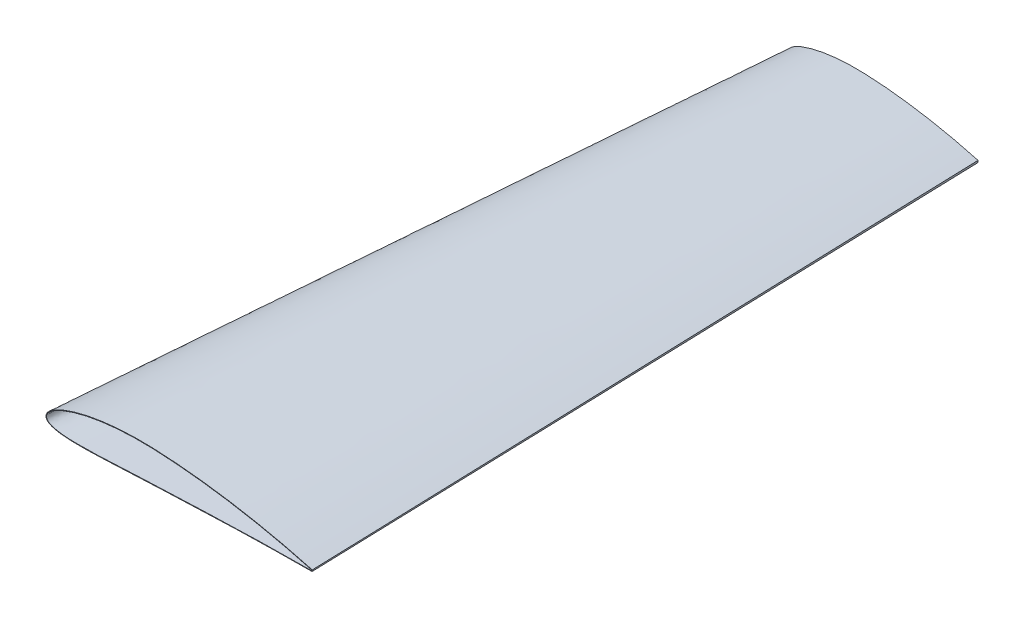
ISO-10303-21;
HEADER;
FILE_DESCRIPTION(('STEP AP214'),'2;1');
FILE_NAME('part.step','',(''),(''),'','','');
FILE_SCHEMA(('AUTOMOTIVE_DESIGN { 1 0 10303 214 1 1 1 1 }'));
ENDSEC;
DATA;
#1=APPLICATION_CONTEXT('core data for automotive mechanical design processes');
#2=APPLICATION_PROTOCOL_DEFINITION('international standard','automotive_design',2000,#1);
#3=PRODUCT_CONTEXT('',#1,'mechanical');
#4=PRODUCT('Part','Part','',(#3));
#5=PRODUCT_RELATED_PRODUCT_CATEGORY('part','',(#4));
#6=PRODUCT_DEFINITION_FORMATION('','',#4);
#7=PRODUCT_DEFINITION_CONTEXT('part definition',#1,'design');
#8=PRODUCT_DEFINITION('design','',#6,#7);
#9=PRODUCT_DEFINITION_SHAPE('','',#8);
#10=(LENGTH_UNIT() NAMED_UNIT(*) SI_UNIT(.MILLI.,.METRE.));
#11=(NAMED_UNIT(*) PLANE_ANGLE_UNIT() SI_UNIT($,.RADIAN.));
#12=(NAMED_UNIT(*) SI_UNIT($,.STERADIAN.) SOLID_ANGLE_UNIT());
#13=UNCERTAINTY_MEASURE_WITH_UNIT(LENGTH_MEASURE(1.E-05),#10,'distance_accuracy_value','');
#14=(GEOMETRIC_REPRESENTATION_CONTEXT(3) GLOBAL_UNCERTAINTY_ASSIGNED_CONTEXT((#13)) GLOBAL_UNIT_ASSIGNED_CONTEXT((#10,
#11,#12)) REPRESENTATION_CONTEXT('',''));
#15=CARTESIAN_POINT('',(0.,0.,0.));
#16=DIRECTION('',(0.,0.,1.));
#17=DIRECTION('',(1.,0.,0.));
#18=AXIS2_PLACEMENT_3D('',#15,#16,#17);
#19=CARTESIAN_POINT('',(515.542466757651,1.37291715323749,0.));
#20=CARTESIAN_POINT('',(473.761354348708,1.91504334392476,-1333.5));
#21=CARTESIAN_POINT('',(504.948186056162,4.31562778068404,0.));
#22=CARTESIAN_POINT('',(466.241241660713,4.00387151815679,-1333.5));
#23=CARTESIAN_POINT('',(483.688630885925,9.95175823918553,0.));
#24=CARTESIAN_POINT('',(451.160493971408,8.03690502890336,-1333.5));
#25=CARTESIAN_POINT('',(440.91840439398,20.2408017386491,0.));
#26=CARTESIAN_POINT('',(420.805599887962,15.3578375738474,-1333.5));
#27=CARTESIAN_POINT('',(397.820792051191,29.0759377638442,0.));
#28=CARTESIAN_POINT('',(390.221957363054,21.65962794748,-1333.5));
#29=CARTESIAN_POINT('',(354.460600672312,36.4782376927597,0.));
#30=CARTESIAN_POINT('',(359.448862171338,26.9396472162238,-1333.5));
#31=CARTESIAN_POINT('',(321.821436127745,41.287280697128,0.));
#32=CARTESIAN_POINT('',(336.282822397605,30.3682918829064,-1333.5));
#33=CARTESIAN_POINT('',(289.075414397088,45.3159399144746,0.));
#34=CARTESIAN_POINT('',(313.039072197383,33.2450825322831,-1333.5));
#35=CARTESIAN_POINT('',(256.234249309476,48.5142512287238,0.));
#36=CARTESIAN_POINT('',(289.723976775768,35.5318134186845,-1333.5));
#37=CARTESIAN_POINT('',(223.317458576892,50.787173233681,0.));
#38=CARTESIAN_POINT('',(266.354818287414,37.1599691175304,-1333.5));
#39=CARTESIAN_POINT('',(190.328241158101,52.0921492363557,0.));
#40=CARTESIAN_POINT('',(242.91690860674,38.106258583374,-1333.5));
#41=CARTESIAN_POINT('',(162.799790856734,51.7149612737425,0.));
#42=CARTESIAN_POINT('',(223.339605024856,37.8569374336063,-1333.5));
#43=CARTESIAN_POINT('',(140.815010685056,50.4814113602434,0.));
#44=CARTESIAN_POINT('',(207.702823599273,36.9927518576321,-1333.5));
#45=CARTESIAN_POINT('',(124.359909385153,49.0521108646724,0.));
#46=CARTESIAN_POINT('',(195.99602938729,35.9854835703815,-1333.5));
#47=CARTESIAN_POINT('',(107.957329171461,47.0863508807158,0.));
#48=CARTESIAN_POINT('',(184.323035776176,34.59573007404,-1333.5));
#49=CARTESIAN_POINT('',(91.631280061329,44.5372092186544,0.));
#50=CARTESIAN_POINT('',(172.700036204777,32.7897404844962,-1333.5));
#51=CARTESIAN_POINT('',(75.4136360051635,41.3429509123251,0.));
#52=CARTESIAN_POINT('',(161.148094659947,30.5229468259909,-1333.5));
#53=CARTESIAN_POINT('',(62.025702194082,38.0735505204426,0.));
#54=CARTESIAN_POINT('',(151.604465980378,28.1992444571214,-1333.5));
#55=CARTESIAN_POINT('',(51.4266197848401,35.0260164169072,0.));
#56=CARTESIAN_POINT('',(144.041887446398,26.0301562795153,-1333.5));
#57=CARTESIAN_POINT('',(43.5465568697689,32.4984583099507,0.));
#58=CARTESIAN_POINT('',(138.41449545024,24.2291788913945,-1333.5));
#59=CARTESIAN_POINT('',(35.7541118725182,29.6956733272348,0.));
#60=CARTESIAN_POINT('',(132.843221370915,22.2293587302536,-1333.5));
#61=CARTESIAN_POINT('',(28.0755124200348,26.5705691180233,0.));
#62=CARTESIAN_POINT('',(127.343608813039,19.9952999808497,-1333.5));
#63=CARTESIAN_POINT('',(20.555874406315,23.0470024261619,0.));
#64=CARTESIAN_POINT('',(121.942599672116,17.4689180578259,-1333.5));
#65=CARTESIAN_POINT('',(14.4837569810482,19.6800078711009,0.));
#66=CARTESIAN_POINT('',(117.559968245804,15.04337614627,-1333.5));
#67=CARTESIAN_POINT('',(9.83082821996991,16.6046362541371,0.));
#68=CARTESIAN_POINT('',(114.174757892656,12.8096231690394,-1333.5));
#69=CARTESIAN_POINT('',(6.4884133940203,14.0525883692153,0.));
#70=CARTESIAN_POINT('',(111.721318113505,10.9395579815021,-1333.5));
#71=CARTESIAN_POINT('',(3.37411745860041,11.1653229429713,0.));
#72=CARTESIAN_POINT('',(109.404447868835,8.79585196070452,-1333.5));
#73=CARTESIAN_POINT('',(1.10893170730452,8.36681188823188,0.));
#74=CARTESIAN_POINT('',(107.664063642287,6.65710221065554,-1333.5));
#75=CARTESIAN_POINT('',(-0.301805281426847,5.74949525675526,0.));
#76=CARTESIAN_POINT('',(106.551977804266,4.5904851843582,-1333.5));
#77=CARTESIAN_POINT('',(-1.01759194588757,3.60243572224438,0.));
#78=CARTESIAN_POINT('',(105.953611387231,2.81739605685466,-1333.5));
#79=CARTESIAN_POINT('',(-1.2495522623254,1.27648595976914,0.));
#80=CARTESIAN_POINT('',(105.759156489465,0.850568134802958,-1333.5));
#81=CARTESIAN_POINT('',(-0.871053522600669,-1.0536259455248,0.));
#82=CARTESIAN_POINT('',(106.089924423004,-1.15154539440468,-1333.5));
#83=CARTESIAN_POINT('',(0.0925312647460494,-3.18620229908168,0.));
#84=CARTESIAN_POINT('',(106.914986624156,-2.95461732726503,-1333.5));
#85=CARTESIAN_POINT('',(1.96587574601528,-5.5997712947529,0.));
#86=CARTESIAN_POINT('',(108.477470245047,-4.94678785829278,-1333.5));
#87=CARTESIAN_POINT('',(4.91676019063022,-7.81472721090731,0.));
#88=CARTESIAN_POINT('',(110.800424548259,-6.66376143743772,-1333.5));
#89=CARTESIAN_POINT('',(8.76335605849131,-9.68666142986385,0.));
#90=CARTESIAN_POINT('',(113.698800911527,-8.06494132796826,-1333.5));
#91=CARTESIAN_POINT('',(12.7457170988457,-11.0838560935036,0.));
#92=CARTESIAN_POINT('',(116.635824452286,-9.08879735743914,-1333.5));
#93=CARTESIAN_POINT('',(16.7924123227071,-12.1621059985243,0.));
#94=CARTESIAN_POINT('',(119.584839473497,-9.87029719797451,-1333.5));
#95=CARTESIAN_POINT('',(22.2359674012003,-13.2958830810498,0.));
#96=CARTESIAN_POINT('',(123.524096136929,-10.6860636031594,-1333.5));
#97=CARTESIAN_POINT('',(29.0875943161226,-14.2923489224896,0.));
#98=CARTESIAN_POINT('',(128.447397124961,-11.3972340966206,-1333.5));
#99=CARTESIAN_POINT('',(37.3368750688352,-15.0677746567505,0.));
#100=CARTESIAN_POINT('',(134.349639581766,-11.947718634808,-1333.5));
#101=CARTESIAN_POINT('',(45.5951521604237,-15.5505139378374,0.));
#102=CARTESIAN_POINT('',(140.242283827755,-12.2886242625503,-1333.5));
#103=CARTESIAN_POINT('',(53.8553570900479,-15.8209667772946,0.));
#104=CARTESIAN_POINT('',(146.127060513623,-12.4782668123123,-1333.5));
#105=CARTESIAN_POINT('',(62.1137750735132,-15.9283521329175,0.));
#106=CARTESIAN_POINT('',(152.003712865923,-12.552064863902,-1333.5));
#107=CARTESIAN_POINT('',(73.1205588589155,-15.9055453611833,0.));
#108=CARTESIAN_POINT('',(159.829522788246,-12.5328344567209,-1333.5));
#109=CARTESIAN_POINT('',(86.8699195436529,-15.6312499740422,0.));
#110=CARTESIAN_POINT('',(169.596582504585,-12.3348738263077,-1333.5));
#111=CARTESIAN_POINT('',(103.354857804001,-15.0577240266216,0.));
#112=CARTESIAN_POINT('',(181.297956986089,-11.9250394308122,-1333.5));
#113=CARTESIAN_POINT('',(119.82883830323,-14.3351980837164,0.));
#114=CARTESIAN_POINT('',(192.985214326049,-11.4106375817264,-1333.5));
#115=CARTESIAN_POINT('',(136.295462455293,-13.5306329693252,0.));
#116=CARTESIAN_POINT('',(204.662814159789,-10.8390693642151,-1333.5));
#117=CARTESIAN_POINT('',(158.245357802019,-12.4217886668498,0.));
#118=CARTESIAN_POINT('',(220.224309063749,-10.0527014635403,-1333.5));
#119=CARTESIAN_POINT('',(185.677219006089,-11.0451104976105,0.));
#120=CARTESIAN_POINT('',(239.663674820272,-9.07928745888814,-1333.5));
#121=CARTESIAN_POINT('',(218.611438330042,-9.79297803817341,0.));
#122=CARTESIAN_POINT('',(263.00207611691,-8.19568423864289,-1333.5));
#123=CARTESIAN_POINT('',(251.555145610756,-8.43171617870903,0.));
#124=CARTESIAN_POINT('',(286.363804333461,-7.22745079121833,-1333.5));
#125=CARTESIAN_POINT('',(284.490185789946,-7.05887027421826,0.));
#126=CARTESIAN_POINT('',(309.70924451459,-6.25554907479826,-1333.5));
#127=CARTESIAN_POINT('',(328.406681851027,-5.3338827127236,0.));
#128=CARTESIAN_POINT('',(340.837133227643,-5.03573266395796,-1333.5));
#129=CARTESIAN_POINT('',(383.311814556076,-3.53289934021423,0.));
#130=CARTESIAN_POINT('',(379.748805846812,-3.76689211807182,-1333.5));
#131=CARTESIAN_POINT('',(449.217902368611,-2.16377935447564,0.));
#132=CARTESIAN_POINT('',(426.454575487254,-2.80665513508761,-1333.5));
#133=CARTESIAN_POINT('',(493.166185563474,-1.76961340399107,0.));
#134=CARTESIAN_POINT('',(457.604517174587,-2.5374479327564,-1333.5));
#135=CARTESIAN_POINT('',(515.140000287505,-1.63716151339865,0.));
#136=CARTESIAN_POINT('',(473.17857996649,-2.44353039794196,-1333.5));
#137=B_SPLINE_SURFACE_WITH_KNOTS('',3,1,((#19,#20),(#21,#22),(#23,#24),(#25,#26),(#27,#28),(#29,
#30),(#31,#32),(#33,#34),(#35,#36),(#37,#38),(#39,#40),(#41,#42),(#43,#44),(#45,#46),(#47,#48),
(#49,#50),(#51,#52),(#53,#54),(#55,#56),(#57,#58),(#59,#60),(#61,#62),(#63,#64),(#65,#66),(#67,
#68),(#69,#70),(#71,#72),(#73,#74),(#75,#76),(#77,#78),(#79,#80),(#81,#82),(#83,#84),(#85,#86),
(#87,#88),(#89,#90),(#91,#92),(#93,#94),(#95,#96),(#97,#98),(#99,#100),(#101,#102),(#103,#104),
(#105,#106),(#107,#108),(#109,#110),(#111,#112),(#113,#114),(#115,#116),(#117,#118),(#119,#120),
(#121,#122),(#123,#124),(#125,#126),(#127,#128),(#129,#130),(#131,#132),(#133,#134),(#135,
#136)),.UNSPECIFIED.,.F.,.F.,.F.,(4,1,1,1,1,1,1,1,1,1,1,1,1,1,1,1,1,1,1,1,1,1,1,1,1,1,1,1,1,1,1,
1,1,1,1,1,1,1,1,1,1,1,1,1,1,1,1,1,1,1,1,1,1,1,1,1,4),(2,2),(0.,0.03125,0.0625,0.125,0.15625,
0.1875,0.21875,0.25,0.28125,0.3125,0.34375,0.359375,0.375,0.390625,0.40625,0.421875,0.4375,
0.4453125,0.453125,0.4609375,0.46875,0.4765625,0.484375,0.48828125,0.4921875,0.49609375,0.5,
0.501953125,0.50390625,0.505859375,0.5078125,0.509765625,0.51171875,0.515625,0.51953125,
0.5234375,0.52734375,0.53125,0.5390625,0.546875,0.5546875,0.5625,0.5703125,0.578125,0.59375,
0.609375,0.625,0.640625,0.65625,0.6875,0.71875,0.75,0.78125,0.8125,0.875,0.9375,1.),(0.,1.),.UNSPECIFIED.);
#138=CARTESIAN_POINT('',(515.542466757651,1.37291715323749,0.));
#139=CARTESIAN_POINT('',(504.948186056162,4.31562778068404,0.));
#140=CARTESIAN_POINT('',(483.688630885925,9.95175823918553,0.));
#141=CARTESIAN_POINT('',(440.91840439398,20.2408017386491,0.));
#142=CARTESIAN_POINT('',(397.820792051191,29.0759377638442,0.));
#143=CARTESIAN_POINT('',(354.460600672312,36.4782376927597,0.));
#144=CARTESIAN_POINT('',(321.821436127745,41.287280697128,0.));
#145=CARTESIAN_POINT('',(289.075414397088,45.3159399144746,0.));
#146=CARTESIAN_POINT('',(256.234249309476,48.5142512287238,0.));
#147=CARTESIAN_POINT('',(223.317458576892,50.787173233681,0.));
#148=CARTESIAN_POINT('',(190.328241158101,52.0921492363557,0.));
#149=CARTESIAN_POINT('',(162.799790856734,51.7149612737425,0.));
#150=CARTESIAN_POINT('',(140.815010685056,50.4814113602434,0.));
#151=CARTESIAN_POINT('',(124.359909385153,49.0521108646724,0.));
#152=CARTESIAN_POINT('',(107.957329171461,47.0863508807158,0.));
#153=CARTESIAN_POINT('',(91.631280061329,44.5372092186544,0.));
#154=CARTESIAN_POINT('',(75.4136360051635,41.3429509123251,0.));
#155=CARTESIAN_POINT('',(62.025702194082,38.0735505204426,0.));
#156=CARTESIAN_POINT('',(51.4266197848401,35.0260164169072,0.));
#157=CARTESIAN_POINT('',(43.5465568697689,32.4984583099507,0.));
#158=CARTESIAN_POINT('',(35.7541118725182,29.6956733272348,0.));
#159=CARTESIAN_POINT('',(28.0755124200348,26.5705691180233,0.));
#160=CARTESIAN_POINT('',(20.555874406315,23.0470024261619,0.));
#161=CARTESIAN_POINT('',(14.4837569810482,19.6800078711009,0.));
#162=CARTESIAN_POINT('',(9.83082821996991,16.6046362541371,0.));
#163=CARTESIAN_POINT('',(6.4884133940203,14.0525883692153,0.));
#164=CARTESIAN_POINT('',(3.37411745860041,11.1653229429713,0.));
#165=CARTESIAN_POINT('',(1.10893170730452,8.36681188823188,0.));
#166=CARTESIAN_POINT('',(-0.301805281426847,5.74949525675526,0.));
#167=CARTESIAN_POINT('',(-1.01759194588757,3.60243572224438,0.));
#168=CARTESIAN_POINT('',(-1.2495522623254,1.27648595976914,0.));
#169=CARTESIAN_POINT('',(-0.871053522600669,-1.0536259455248,0.));
#170=CARTESIAN_POINT('',(0.0925312647460494,-3.18620229908168,0.));
#171=CARTESIAN_POINT('',(1.96587574601528,-5.5997712947529,0.));
#172=CARTESIAN_POINT('',(4.91676019063022,-7.81472721090731,0.));
#173=CARTESIAN_POINT('',(8.76335605849131,-9.68666142986385,0.));
#174=CARTESIAN_POINT('',(12.7457170988457,-11.0838560935036,0.));
#175=CARTESIAN_POINT('',(16.7924123227071,-12.1621059985243,0.));
#176=CARTESIAN_POINT('',(22.2359674012003,-13.2958830810498,0.));
#177=CARTESIAN_POINT('',(29.0875943161226,-14.2923489224896,0.));
#178=CARTESIAN_POINT('',(37.3368750688352,-15.0677746567505,0.));
#179=CARTESIAN_POINT('',(45.5951521604237,-15.5505139378374,0.));
#180=CARTESIAN_POINT('',(53.8553570900479,-15.8209667772946,0.));
#181=CARTESIAN_POINT('',(62.1137750735132,-15.9283521329175,0.));
#182=CARTESIAN_POINT('',(73.1205588589155,-15.9055453611833,0.));
#183=CARTESIAN_POINT('',(86.8699195436529,-15.6312499740422,0.));
#184=CARTESIAN_POINT('',(103.354857804001,-15.0577240266216,0.));
#185=CARTESIAN_POINT('',(119.82883830323,-14.3351980837164,0.));
#186=CARTESIAN_POINT('',(136.295462455293,-13.5306329693252,0.));
#187=CARTESIAN_POINT('',(158.245357802019,-12.4217886668498,0.));
#188=CARTESIAN_POINT('',(185.677219006089,-11.0451104976105,0.));
#189=CARTESIAN_POINT('',(218.611438330042,-9.79297803817341,0.));
#190=CARTESIAN_POINT('',(251.555145610756,-8.43171617870903,0.));
#191=CARTESIAN_POINT('',(284.490185789946,-7.05887027421826,0.));
#192=CARTESIAN_POINT('',(328.406681851027,-5.3338827127236,0.));
#193=CARTESIAN_POINT('',(383.311814556076,-3.53289934021423,0.));
#194=CARTESIAN_POINT('',(449.217902368611,-2.16377935447564,0.));
#195=CARTESIAN_POINT('',(493.166185563474,-1.76961340399107,0.));
#196=CARTESIAN_POINT('',(515.140000287505,-1.63716151339865,0.));
#197=B_SPLINE_CURVE_WITH_KNOTS('',3,(#138,#139,#140,#141,#142,#143,#144,#145,#146,#147,#148,
#149,#150,#151,#152,#153,#154,#155,#156,#157,#158,#159,#160,#161,#162,#163,#164,#165,#166,#167,
#168,#169,#170,#171,#172,#173,#174,#175,#176,#177,#178,#179,#180,#181,#182,#183,#184,#185,#186,
#187,#188,#189,#190,#191,#192,#193,#194,#195,#196),.UNSPECIFIED.,.F.,.F.,(4,1,1,1,1,1,1,1,1,1,1,
1,1,1,1,1,1,1,1,1,1,1,1,1,1,1,1,1,1,1,1,1,1,1,1,1,1,1,1,1,1,1,1,1,1,1,1,1,1,1,1,1,1,1,1,1,4),
(0.,0.03125,0.0625,0.125,0.15625,0.1875,0.21875,0.25,0.28125,0.3125,0.34375,0.359375,0.375,
0.390625,0.40625,0.421875,0.4375,0.4453125,0.453125,0.4609375,0.46875,0.4765625,0.484375,
0.48828125,0.4921875,0.49609375,0.5,0.501953125,0.50390625,0.505859375,0.5078125,0.509765625,
0.51171875,0.515625,0.51953125,0.5234375,0.52734375,0.53125,0.5390625,0.546875,0.5546875,0.5625,
0.5703125,0.578125,0.59375,0.609375,0.625,0.640625,0.65625,0.6875,0.71875,0.75,0.78125,0.8125,
0.875,0.9375,1.),.UNSPECIFIED.);
#198=CARTESIAN_POINT('',(515.542466757651,1.37291715323749,0.));
#199=VERTEX_POINT('',#198);
#200=CARTESIAN_POINT('',(515.140000287505,-1.63716151339865,0.));
#201=VERTEX_POINT('',#200);
#202=EDGE_CURVE('E11',#199,#201,#197,.T.);
#203=DIRECTION('',(-0.0313165474447222,0.000406344388476608,-0.999509434042711));
#204=VECTOR('',#203,1.);
#205=CARTESIAN_POINT('',(494.651910553179,1.64398024858112,-666.75));
#206=LINE('',#205,#204);
#207=CARTESIAN_POINT('',(473.761354348708,1.91504334392476,-1333.5));
#208=VERTEX_POINT('',#207);
#209=EDGE_CURVE('E115',#199,#208,#206,.T.);
#210=CARTESIAN_POINT('',(473.761354348708,1.91504334392476,-1333.5));
#211=CARTESIAN_POINT('',(466.241241660713,4.00387151815679,-1333.5));
#212=CARTESIAN_POINT('',(451.160493971408,8.03690502890336,-1333.5));
#213=CARTESIAN_POINT('',(420.805599887962,15.3578375738474,-1333.5));
#214=CARTESIAN_POINT('',(390.221957363054,21.65962794748,-1333.5));
#215=CARTESIAN_POINT('',(359.448862171338,26.9396472162238,-1333.5));
#216=CARTESIAN_POINT('',(336.282822397605,30.3682918829064,-1333.5));
#217=CARTESIAN_POINT('',(313.039072197383,33.2450825322831,-1333.5));
#218=CARTESIAN_POINT('',(289.723976775768,35.5318134186845,-1333.5));
#219=CARTESIAN_POINT('',(266.354818287414,37.1599691175304,-1333.5));
#220=CARTESIAN_POINT('',(242.91690860674,38.106258583374,-1333.5));
#221=CARTESIAN_POINT('',(223.339605024856,37.8569374336063,-1333.5));
#222=CARTESIAN_POINT('',(207.702823599273,36.9927518576321,-1333.5));
#223=CARTESIAN_POINT('',(195.99602938729,35.9854835703815,-1333.5));
#224=CARTESIAN_POINT('',(184.323035776176,34.59573007404,-1333.5));
#225=CARTESIAN_POINT('',(172.700036204777,32.7897404844962,-1333.5));
#226=CARTESIAN_POINT('',(161.148094659947,30.5229468259909,-1333.5));
#227=CARTESIAN_POINT('',(151.604465980378,28.1992444571214,-1333.5));
#228=CARTESIAN_POINT('',(144.041887446398,26.0301562795153,-1333.5));
#229=CARTESIAN_POINT('',(138.41449545024,24.2291788913945,-1333.5));
#230=CARTESIAN_POINT('',(132.843221370915,22.2293587302536,-1333.5));
#231=CARTESIAN_POINT('',(127.343608813039,19.9952999808497,-1333.5));
#232=CARTESIAN_POINT('',(121.942599672116,17.4689180578259,-1333.5));
#233=CARTESIAN_POINT('',(117.559968245804,15.04337614627,-1333.5));
#234=CARTESIAN_POINT('',(114.174757892656,12.8096231690394,-1333.5));
#235=CARTESIAN_POINT('',(111.721318113505,10.9395579815021,-1333.5));
#236=CARTESIAN_POINT('',(109.404447868835,8.79585196070452,-1333.5));
#237=CARTESIAN_POINT('',(107.664063642287,6.65710221065554,-1333.5));
#238=CARTESIAN_POINT('',(106.551977804266,4.5904851843582,-1333.5));
#239=CARTESIAN_POINT('',(105.953611387231,2.81739605685466,-1333.5));
#240=CARTESIAN_POINT('',(105.759156489465,0.850568134802958,-1333.5));
#241=CARTESIAN_POINT('',(106.089924423004,-1.15154539440468,-1333.5));
#242=CARTESIAN_POINT('',(106.914986624156,-2.95461732726503,-1333.5));
#243=CARTESIAN_POINT('',(108.477470245047,-4.94678785829278,-1333.5));
#244=CARTESIAN_POINT('',(110.800424548259,-6.66376143743772,-1333.5));
#245=CARTESIAN_POINT('',(113.698800911527,-8.06494132796826,-1333.5));
#246=CARTESIAN_POINT('',(116.635824452286,-9.08879735743914,-1333.5));
#247=CARTESIAN_POINT('',(119.584839473497,-9.87029719797451,-1333.5));
#248=CARTESIAN_POINT('',(123.524096136929,-10.6860636031594,-1333.5));
#249=CARTESIAN_POINT('',(128.447397124961,-11.3972340966206,-1333.5));
#250=CARTESIAN_POINT('',(134.349639581766,-11.947718634808,-1333.5));
#251=CARTESIAN_POINT('',(140.242283827755,-12.2886242625503,-1333.5));
#252=CARTESIAN_POINT('',(146.127060513623,-12.4782668123123,-1333.5));
#253=CARTESIAN_POINT('',(152.003712865923,-12.552064863902,-1333.5));
#254=CARTESIAN_POINT('',(159.829522788246,-12.5328344567209,-1333.5));
#255=CARTESIAN_POINT('',(169.596582504585,-12.3348738263077,-1333.5));
#256=CARTESIAN_POINT('',(181.297956986089,-11.9250394308122,-1333.5));
#257=CARTESIAN_POINT('',(192.985214326049,-11.4106375817264,-1333.5));
#258=CARTESIAN_POINT('',(204.662814159789,-10.8390693642151,-1333.5));
#259=CARTESIAN_POINT('',(220.224309063749,-10.0527014635403,-1333.5));
#260=CARTESIAN_POINT('',(239.663674820272,-9.07928745888814,-1333.5));
#261=CARTESIAN_POINT('',(263.00207611691,-8.19568423864289,-1333.5));
#262=CARTESIAN_POINT('',(286.363804333461,-7.22745079121833,-1333.5));
#263=CARTESIAN_POINT('',(309.70924451459,-6.25554907479826,-1333.5));
#264=CARTESIAN_POINT('',(340.837133227643,-5.03573266395796,-1333.5));
#265=CARTESIAN_POINT('',(379.748805846812,-3.76689211807182,-1333.5));
#266=CARTESIAN_POINT('',(426.454575487254,-2.80665513508761,-1333.5));
#267=CARTESIAN_POINT('',(457.604517174587,-2.5374479327564,-1333.5));
#268=CARTESIAN_POINT('',(473.17857996649,-2.44353039794196,-1333.5));
#269=B_SPLINE_CURVE_WITH_KNOTS('',3,(#210,#211,#212,#213,#214,#215,#216,#217,#218,#219,#220,
#221,#222,#223,#224,#225,#226,#227,#228,#229,#230,#231,#232,#233,#234,#235,#236,#237,#238,#239,
#240,#241,#242,#243,#244,#245,#246,#247,#248,#249,#250,#251,#252,#253,#254,#255,#256,#257,#258,
#259,#260,#261,#262,#263,#264,#265,#266,#267,#268),.UNSPECIFIED.,.F.,.F.,(4,1,1,1,1,1,1,1,1,1,1,
1,1,1,1,1,1,1,1,1,1,1,1,1,1,1,1,1,1,1,1,1,1,1,1,1,1,1,1,1,1,1,1,1,1,1,1,1,1,1,1,1,1,1,1,1,4),
(0.,0.03125,0.0625,0.125,0.15625,0.1875,0.21875,0.25,0.28125,0.3125,0.34375,0.359375,0.375,
0.390625,0.40625,0.421875,0.4375,0.4453125,0.453125,0.4609375,0.46875,0.4765625,0.484375,
0.48828125,0.4921875,0.49609375,0.5,0.501953125,0.50390625,0.505859375,0.5078125,0.509765625,
0.51171875,0.515625,0.51953125,0.5234375,0.52734375,0.53125,0.5390625,0.546875,0.5546875,0.5625,
0.5703125,0.578125,0.59375,0.609375,0.625,0.640625,0.65625,0.6875,0.71875,0.75,0.78125,0.8125,
0.875,0.9375,1.),.UNSPECIFIED.);
#270=CARTESIAN_POINT('',(473.17857996649,-2.44353039794196,-1333.5));
#271=VERTEX_POINT('',#270);
#272=EDGE_CURVE('E98',#208,#271,#269,.T.);
#273=DIRECTION('',(-0.0314515585962615,-0.000604401805953986,-0.999505094614491));
#274=VECTOR('',#273,1.);
#275=CARTESIAN_POINT('',(494.159290126997,-2.0403459556703,-666.75));
#276=LINE('',#275,#274);
#277=EDGE_CURVE('E52',#201,#271,#276,.T.);
#278=ORIENTED_EDGE('',*,*,#202,.F.);
#279=ORIENTED_EDGE('',*,*,#209,.T.);
#280=ORIENTED_EDGE('',*,*,#272,.T.);
#281=ORIENTED_EDGE('',*,*,#277,.F.);
#282=EDGE_LOOP('',(#278,#279,#280,#281));
#283=FACE_BOUND('',#282,.T.);
#284=ADVANCED_FACE('F43',(#283),#137,.F.);
#285=CARTESIAN_POINT('',(515.140000287505,-1.63716151339865,0.));
#286=DIRECTION('',(0.99070012302079,-0.132462844212288,-0.0310943909697982));
#287=DIRECTION('',(0.13252692727453,0.991179405328405,0.));
#288=AXIS2_PLACEMENT_3D('',#285,#286,#287);
#289=PLANE('',#288);
#290=DIRECTION('',(0.13252692727453,0.991179405328405,0.));
#291=VECTOR('',#290,1.);
#292=CARTESIAN_POINT('',(515.341233522578,-0.132122180080578,0.));
#293=LINE('',#292,#291);
#294=EDGE_CURVE('E121',#201,#199,#293,.T.);
#295=ORIENTED_EDGE('',*,*,#294,.F.);
#296=ORIENTED_EDGE('',*,*,#277,.T.);
#297=DIRECTION('',(0.13252818509165,0.991179237149524,0.));
#298=VECTOR('',#297,1.);
#299=CARTESIAN_POINT('',(473.469967157599,-0.264243527008601,-1333.5));
#300=LINE('',#299,#298);
#301=EDGE_CURVE('E47',#271,#208,#300,.T.);
#302=ORIENTED_EDGE('',*,*,#301,.T.);
#303=ORIENTED_EDGE('',*,*,#209,.F.);
#304=EDGE_LOOP('',(#295,#296,#302,#303));
#305=FACE_BOUND('',#304,.T.);
#306=ADVANCED_FACE('F45',(#305),#289,.T.);
#307=CARTESIAN_POINT('',(0.789698427813787,7.6809404147223,0.));
#308=DIRECTION('',(0.,0.,1.));
#309=DIRECTION('',(-1.,0.,0.));
#310=AXIS2_PLACEMENT_3D('',#307,#308,#309);
#311=PLANE('',#310);
#312=DIRECTION('',(0.132526927273884,0.991179405328492,0.));
#313=VECTOR('',#312,1.);
#314=CARTESIAN_POINT('',(514.35,0.,0.));
#315=LINE('',#314,#313);
#316=CARTESIAN_POINT('',(514.264104,-0.642423,0.));
#317=VERTEX_POINT('',#316);
#318=CARTESIAN_POINT('',(514.435896,0.642423,0.));
#319=VERTEX_POINT('',#318);
#320=EDGE_CURVE('E90',#317,#319,#315,.T.);
#321=ORIENTED_EDGE('',*,*,#320,.F.);
#322=CARTESIAN_POINT('',(514.435896,0.642423,0.));
#323=CARTESIAN_POINT('',(512.94541606473,1.05642478729432,0.));
#324=CARTESIAN_POINT('',(508.825527987807,2.19256313847687,0.));
#325=CARTESIAN_POINT('',(498.403665900981,5.01203318174744,0.));
#326=CARTESIAN_POINT('',(480.522495849854,9.65821949062991,0.));
#327=CARTESIAN_POINT('',(461.6976352898,14.2178535400194,0.));
#328=CARTESIAN_POINT('',(441.398480906032,18.8488091834658,0.));
#329=CARTESIAN_POINT('',(425.837811960539,22.2064809442018,0.));
#330=CARTESIAN_POINT('',(404.739444713579,26.4880124213888,0.));
#331=CARTESIAN_POINT('',(386.633295981129,29.9022035696143,0.));
#332=CARTESIAN_POINT('',(367.797715069162,33.1789779456841,0.));
#333=CARTESIAN_POINT('',(347.785757595347,36.4491216571071,0.));
#334=CARTESIAN_POINT('',(321.929657212203,40.2530036004365,0.));
#335=CARTESIAN_POINT('',(290.1575236074,44.1855594770424,0.));
#336=CARTESIAN_POINT('',(263.205160570892,46.8408013496332,0.));
#337=CARTESIAN_POINT('',(241.481594589181,48.5315437184497,0.));
#338=CARTESIAN_POINT('',(225.228952555751,49.5578635284934,0.));
#339=CARTESIAN_POINT('',(209.026056900066,50.3454166531266,0.));
#340=CARTESIAN_POINT('',(192.91849394169,50.8313771990957,0.));
#341=CARTESIAN_POINT('',(176.973461880223,50.8910826974378,0.));
#342=CARTESIAN_POINT('',(156.379693514986,50.443365915704,0.));
#343=CARTESIAN_POINT('',(131.753417716594,48.9407852546156,0.));
#344=CARTESIAN_POINT('',(108.05912810278,46.1590202990312,0.));
#345=CARTESIAN_POINT('',(90.3059853486501,43.2428512836833,0.));
#346=CARTESIAN_POINT('',(77.9859974202083,40.8195537307709,0.));
#347=CARTESIAN_POINT('',(66.4275233836712,38.1487409922866,0.));
#348=CARTESIAN_POINT('',(55.6793455107768,35.2676421154893,0.));
#349=CARTESIAN_POINT('',(45.7858241467059,32.2152976573816,0.));
#350=CARTESIAN_POINT('',(36.7859672757282,29.0315137261456,0.));
#351=CARTESIAN_POINT('',(28.7128278267648,25.7579258766505,0.));
#352=CARTESIAN_POINT('',(21.5951478101318,22.4321597042956,0.));
#353=CARTESIAN_POINT('',(15.4550025655565,19.0919579210996,0.));
#354=CARTESIAN_POINT('',(10.3087653268058,15.7705328063585,0.));
#355=CARTESIAN_POINT('',(6.16514914406117,12.4956664129553,0.));
#356=CARTESIAN_POINT('',(3.02641944483636,9.28349534240597,0.));
#357=CARTESIAN_POINT('',(0.892546496087793,6.13234383969225,0.));
#358=CARTESIAN_POINT('',(-0.207749289706149,3.01155653148428,0.));
#359=CARTESIAN_POINT('',(-0.180705806156611,-0.0362548467185213,0.));
#360=CARTESIAN_POINT('',(0.964936352383728,-2.85745424735354,0.));
#361=CARTESIAN_POINT('',(3.15942728449595,-5.31808870006715,0.));
#362=CARTESIAN_POINT('',(6.28988095208388,-7.43127852790095,0.));
#363=CARTESIAN_POINT('',(10.3346827005672,-9.249116332702,0.));
#364=CARTESIAN_POINT('',(15.2853400246204,-10.7963791421872,0.));
#365=CARTESIAN_POINT('',(21.128740187722,-12.0830529684782,0.));
#366=CARTESIAN_POINT('',(27.8434078851453,-13.1181164538871,0.));
#367=CARTESIAN_POINT('',(35.402386955595,-13.909930601921,0.));
#368=CARTESIAN_POINT('',(43.774859618114,-14.4685589897819,0.));
#369=CARTESIAN_POINT('',(52.9268307234789,-14.8088115512827,0.));
#370=CARTESIAN_POINT('',(62.8222991220521,-14.9425562599767,0.));
#371=CARTESIAN_POINT('',(73.4230791296659,-14.8903632448912,0.));
#372=CARTESIAN_POINT('',(84.6899003138328,-14.669251653047,0.));
#373=CARTESIAN_POINT('',(96.5819965888191,-14.3020165903753,0.));
#374=CARTESIAN_POINT('',(113.568649316398,-13.6339776986205,0.));
#375=CARTESIAN_POINT('',(136.038145587383,-12.55213020457,0.));
#376=CARTESIAN_POINT('',(159.255895604522,-11.3625421508041,0.));
#377=CARTESIAN_POINT('',(178.63980440041,-10.426403347717,0.));
#378=CARTESIAN_POINT('',(193.687789822616,-9.74571384869642,0.));
#379=CARTESIAN_POINT('',(209.076975035284,-9.14665953276347,0.));
#380=CARTESIAN_POINT('',(224.747841415959,-8.53645233231427,0.));
#381=CARTESIAN_POINT('',(251.268043050231,-7.44592583941877,0.));
#382=CARTESIAN_POINT('',(288.183310261078,-5.89213782868748,0.));
#383=CARTESIAN_POINT('',(324.855252418006,-4.48957076349408,0.));
#384=CARTESIAN_POINT('',(350.49312127892,-3.63029902647992,0.));
#385=CARTESIAN_POINT('',(378.655916259754,-2.75217689665205,0.));
#386=CARTESIAN_POINT('',(405.834971812742,-2.0685118801751,0.));
#387=CARTESIAN_POINT('',(435.510495417732,-1.50653575485183,0.));
#388=CARTESIAN_POINT('',(456.175948723462,-1.17512970443536,0.));
#389=CARTESIAN_POINT('',(475.257418188367,-0.951341238396082,0.));
#390=CARTESIAN_POINT('',(490.933297619623,-0.80445748931804,0.));
#391=CARTESIAN_POINT('',(500.158698947766,-0.732541232247515,0.));
#392=CARTESIAN_POINT('',(508.450560131903,-0.676259098232435,0.));
#393=CARTESIAN_POINT('',(512.718654990296,-0.651738526034978,0.));
#394=CARTESIAN_POINT('',(514.264104,-0.642423,0.));
#395=B_SPLINE_CURVE_WITH_KNOTS('',3,(#322,#323,#324,#325,#326,#327,#328,#329,#330,#331,#332,
#333,#334,#335,#336,#337,#338,#339,#340,#341,#342,#343,#344,#345,#346,#347,#348,#349,#350,#351,
#352,#353,#354,#355,#356,#357,#358,#359,#360,#361,#362,#363,#364,#365,#366,#367,#368,#369,#370,
#371,#372,#373,#374,#375,#376,#377,#378,#379,#380,#381,#382,#383,#384,#385,#386,#387,#388,#389,
#390,#391,#392,#393,#394),.UNSPECIFIED.,.F.,.F.,(4,1,1,1,1,1,1,1,1,1,1,1,1,1,1,1,1,1,1,1,1,1,1,
1,1,1,1,1,1,1,1,1,1,1,1,1,1,1,1,1,1,1,1,1,1,1,1,1,1,1,1,1,1,1,1,1,1,1,1,1,1,1,1,1,1,1,1,1,1,1,
4),(0.,0.00440644036857422,0.0121737299937428,0.0307541939074956,0.0570317960242728,
0.0673450879951363,0.0900623576232318,0.10237566463772,0.128668991756761,0.142544998543184,
0.15683462681616,0.18642899877217,0.216985200702991,0.248022540320765,0.263568549379391,
0.27905079415257,0.294409505596858,0.30977601328067,0.324950675699587,0.339824563938648,
0.368445781112026,0.395201613054168,0.407751474728481,0.419686063023906,0.43096195418779,
0.441537442035329,0.451376775359951,0.460447411472792,0.468722554437909,0.476182575407291,
0.482814921279424,0.488618662978692,0.493609654903146,0.497829924786717,0.501364693853581,
0.504371830566402,0.507112524612496,0.509853114307978,0.512854812617694,0.516367768618666,
0.52053959257564,0.525445047045249,0.531118392327961,0.537568297479124,0.544788289677284,
0.552761790220897,0.561466342861132,0.570873121381836,0.580950014659322,0.591662173849693,
0.602972463274888,0.614840808775719,0.640086430252391,0.667051539604885,0.681064303706584,
0.695366712683046,0.709960021857495,0.724934164323908,0.740039734181759,0.785567804764558,
0.830182037591703,0.844577388167962,0.858639375621105,0.910443941544171,0.922021682965094,
0.943186534459237,0.969317876146513,0.976379715358717,0.987841938817817,0.99559763857599,1.),.UNSPECIFIED.);
#396=EDGE_CURVE('E86',#319,#317,#395,.T.);
#397=ORIENTED_EDGE('',*,*,#396,.F.);
#398=EDGE_LOOP('',(#321,#397));
#399=FACE_BOUND('',#398,.T.);
#400=ORIENTED_EDGE('',*,*,#294,.T.);
#401=ORIENTED_EDGE('',*,*,#202,.T.);
#402=EDGE_LOOP('',(#400,#401));
#403=FACE_BOUND('',#402,.T.);
#404=ADVANCED_FACE('F93',(#399,#403),#311,.T.);
#405=CARTESIAN_POINT('',(107.40939397805,6.11081318522634,-1333.5));
#406=DIRECTION('',(0.,0.,1.));
#407=DIRECTION('',(-1.,0.,0.));
#408=AXIS2_PLACEMENT_3D('',#405,#406,#407);
#409=PLANE('',#408);
#410=CARTESIAN_POINT('',(471.548210999999,0.454057999987208,-1333.5));
#411=CARTESIAN_POINT('',(470.494753754272,0.746672122477082,-1333.5));
#412=CARTESIAN_POINT('',(467.582858646706,1.5496815807817,-1333.5));
#413=CARTESIAN_POINT('',(460.216788574629,3.54245650519408,-1333.5));
#414=CARTESIAN_POINT('',(447.578553463452,6.82633180706164,-1333.5));
#415=CARTESIAN_POINT('',(434.273328814241,10.0490386732759,-1333.5));
#416=CARTESIAN_POINT('',(419.926087189139,13.3221532297202,-1333.5));
#417=CARTESIAN_POINT('',(408.927959425464,15.6953211175711,-1333.5));
#418=CARTESIAN_POINT('',(394.015842123828,18.7214664036661,-1333.5));
#419=CARTESIAN_POINT('',(381.218595098486,21.1345812654302,-1333.5));
#420=CARTESIAN_POINT('',(367.905792856357,23.4505740973592,-1333.5));
#421=CARTESIAN_POINT('',(353.761538310277,25.7618787300853,-1333.5));
#422=CARTESIAN_POINT('',(335.486701716051,28.4504232108985,-1333.5));
#423=CARTESIAN_POINT('',(313.030471822044,31.2299172839469,-1333.5));
#424=CARTESIAN_POINT('',(293.980807719015,33.1066147362166,-1333.5));
#425=CARTESIAN_POINT('',(278.626806044593,34.3016163153823,-1333.5));
#426=CARTESIAN_POINT('',(267.139599487229,35.0270082162218,-1333.5));
#427=CARTESIAN_POINT('',(255.68755287874,35.5836425109885,-1333.5));
#428=CARTESIAN_POINT('',(244.302886345107,35.927115011996,-1333.5));
#429=CARTESIAN_POINT('',(233.03309484109,35.9693136697484,-1333.5));
#430=CARTESIAN_POINT('',(218.477622951542,35.6528728571563,-1333.5));
#431=CARTESIAN_POINT('',(201.072014755019,34.5908623765454,-1333.5));
#432=CARTESIAN_POINT('',(184.325124716788,32.6247399387227,-1333.5));
#433=CARTESIAN_POINT('',(171.777378415618,30.5636207824256,-1333.5));
#434=CARTESIAN_POINT('',(163.069732670962,28.8508575855725,-1333.5));
#435=CARTESIAN_POINT('',(154.900317065627,26.9631539946023,-1333.5));
#436=CARTESIAN_POINT('',(147.303611251825,24.9268214541628,-1333.5));
#437=CARTESIAN_POINT('',(140.310968151963,22.769453635662,-1333.5));
#438=CARTESIAN_POINT('',(133.949958304024,20.5191869488186,-1333.5));
#439=CARTESIAN_POINT('',(128.243943222938,18.2054477590111,-1333.5));
#440=CARTESIAN_POINT('',(123.213237815739,15.8548286689227,-1333.5));
#441=CARTESIAN_POINT('',(118.873443260835,13.4940076202957,-1333.5));
#442=CARTESIAN_POINT('',(115.236133633843,11.1464567811042,-1333.5));
#443=CARTESIAN_POINT('',(112.307465918484,8.83181420624795,-1333.5));
#444=CARTESIAN_POINT('',(110.08904347215,6.5614828531469,-1333.5));
#445=CARTESIAN_POINT('',(108.580843334353,4.33427994666272,-1333.5));
#446=CARTESIAN_POINT('',(107.80316531111,2.12853842165356,-1333.5));
#447=CARTESIAN_POINT('',(107.822278679744,-0.0256246268723389,-1333.5));
#448=CARTESIAN_POINT('',(108.632008069895,-2.01962024822909,-1333.5));
#449=CARTESIAN_POINT('',(110.183051961843,-3.75877273588915,-1333.5));
#450=CARTESIAN_POINT('',(112.395626013006,-5.25235382542728,-1333.5));
#451=CARTESIAN_POINT('',(115.25445101078,-6.53718512599626,-1333.5));
#452=CARTESIAN_POINT('',(118.753527326803,-7.63077372493691,-1333.5));
#453=CARTESIAN_POINT('',(122.883584864182,-8.5401822189999,-1333.5));
#454=CARTESIAN_POINT('',(127.629445640547,-9.27175628389868,-1333.5));
#455=CARTESIAN_POINT('',(132.972057337769,-9.83140097628574,-1333.5));
#456=CARTESIAN_POINT('',(138.889638054262,-10.2262353599569,-1333.5));
#457=CARTESIAN_POINT('',(145.358160775775,-10.4667209136588,-1333.5));
#458=CARTESIAN_POINT('',(152.352180294713,-10.5612512049219,-1333.5));
#459=CARTESIAN_POINT('',(159.844707071525,-10.5243613303354,-1333.5));
#460=CARTESIAN_POINT('',(167.807985065512,-10.3680815224385,-1333.5));
#461=CARTESIAN_POINT('',(176.213201295296,-10.1085245112694,-1333.5));
#462=CARTESIAN_POINT('',(188.219199631016,-9.63635992298278,-1333.5));
#463=CARTESIAN_POINT('',(204.100417700833,-8.87171960345737,-1333.5));
#464=CARTESIAN_POINT('',(220.510493957693,-8.03093220714318,-1333.5));
#465=CARTESIAN_POINT('',(234.210849069535,-7.36927959083769,-1333.5));
#466=CARTESIAN_POINT('',(244.846616793399,-6.88817544351863,-1333.5));
#467=CARTESIAN_POINT('',(255.72354084923,-6.4647680381547,-1333.5));
#468=CARTESIAN_POINT('',(266.799554765253,-6.03348112050647,-1333.5));
#469=CARTESIAN_POINT('',(285.543771333332,-5.26270616042734,-1333.5));
#470=CARTESIAN_POINT('',(311.635117149994,-4.16450503488361,-1333.5));
#471=CARTESIAN_POINT('',(337.554484160904,-3.17318302443308,-1333.5));
#472=CARTESIAN_POINT('',(355.67507629834,-2.56585970842198,-1333.5));
#473=CARTESIAN_POINT('',(375.580262074813,-1.94521060265128,-1333.5));
#474=CARTESIAN_POINT('',(394.790150732246,-1.4620028025464,-1333.5));
#475=CARTESIAN_POINT('',(415.764516641898,-1.06480467367074,-1333.5));
#476=CARTESIAN_POINT('',(430.370654857757,-0.830568995520572,-1333.5));
#477=CARTESIAN_POINT('',(443.857249442588,-0.672400602459617,-1333.5));
#478=CARTESIAN_POINT('',(454.936805434006,-0.568581926745332,-1333.5));
#479=CARTESIAN_POINT('',(461.457228295663,-0.517751755927463,-1333.5));
#480=CARTESIAN_POINT('',(467.317833669565,-0.477973145484204,-1333.5));
#481=CARTESIAN_POINT('',(470.334484120158,-0.460645014779035,-1333.5));
#482=CARTESIAN_POINT('',(471.426788999999,-0.454058000012805,-1333.5));
#483=B_SPLINE_CURVE_WITH_KNOTS('',3,(#410,#411,#412,#413,#414,#415,#416,#417,#418,#419,#420,
#421,#422,#423,#424,#425,#426,#427,#428,#429,#430,#431,#432,#433,#434,#435,#436,#437,#438,#439,
#440,#441,#442,#443,#444,#445,#446,#447,#448,#449,#450,#451,#452,#453,#454,#455,#456,#457,#458,
#459,#460,#461,#462,#463,#464,#465,#466,#467,#468,#469,#470,#471,#472,#473,#474,#475,#476,#477,
#478,#479,#480,#481,#482),.UNSPECIFIED.,.F.,.F.,(4,1,1,1,1,1,1,1,1,1,1,1,1,1,1,1,1,1,1,1,1,1,1,
1,1,1,1,1,1,1,1,1,1,1,1,1,1,1,1,1,1,1,1,1,1,1,1,1,1,1,1,1,1,1,1,1,1,1,1,1,1,1,1,1,1,1,1,1,1,1,
4),(0.,0.00440644036857422,0.0121737299937428,0.0307541939074956,0.0570317960242728,
0.0673450879951363,0.0900623576232318,0.10237566463772,0.128668991756761,0.142544998543184,
0.15683462681616,0.18642899877217,0.216985200702991,0.248022540320765,0.263568549379391,
0.27905079415257,0.294409505596858,0.30977601328067,0.324950675699587,0.339824563938648,
0.368445781112026,0.395201613054168,0.407751474728481,0.419686063023906,0.43096195418779,
0.441537442035329,0.451376775359951,0.460447411472792,0.468722554437909,0.476182575407291,
0.482814921279424,0.488618662978692,0.493609654903146,0.497829924786717,0.501364693853581,
0.504371830566402,0.507112524612496,0.509853114307978,0.512854812617694,0.516367768618666,
0.52053959257564,0.525445047045249,0.531118392327961,0.537568297479124,0.544788289677284,
0.552761790220897,0.561466342861132,0.570873121381836,0.580950014659322,0.591662173849693,
0.602972463274888,0.614840808775719,0.640086430252391,0.667051539604885,0.681064303706584,
0.695366712683046,0.709960021857495,0.724934164323908,0.740039734181759,0.785567804764558,
0.830182037591703,0.844577388167962,0.858639375621105,0.910443941544171,0.922021682965094,
0.943186534459237,0.969317876146513,0.976379715358717,0.987841938817817,0.99559763857599,1.),.UNSPECIFIED.);
#484=CARTESIAN_POINT('',(471.548210999999,0.454057999987209,-1333.5));
#485=VERTEX_POINT('',#484);
#486=CARTESIAN_POINT('',(471.426788999999,-0.454058000012805,-1333.5));
#487=VERTEX_POINT('',#486);
#488=EDGE_CURVE('E89',#485,#487,#483,.T.);
#489=ORIENTED_EDGE('',*,*,#488,.T.);
#490=DIRECTION('',(0.132528185092149,0.991179237149458,0.));
#491=VECTOR('',#490,1.);
#492=CARTESIAN_POINT('',(471.487499999999,-1.27983561248879E-11,-1333.5));
#493=LINE('',#492,#491);
#494=EDGE_CURVE('E104',#487,#485,#493,.T.);
#495=ORIENTED_EDGE('',*,*,#494,.T.);
#496=EDGE_LOOP('',(#489,#495));
#497=FACE_BOUND('',#496,.T.);
#498=ORIENTED_EDGE('',*,*,#272,.F.);
#499=ORIENTED_EDGE('',*,*,#301,.F.);
#500=EDGE_LOOP('',(#498,#499));
#501=FACE_BOUND('',#500,.T.);
#502=ADVANCED_FACE('F130',(#497,#501),#409,.F.);
#503=CARTESIAN_POINT('',(514.264104,-0.642423,0.));
#504=DIRECTION('',(0.990676755749762,-0.132459719860366,-0.0318431818705373));
#505=DIRECTION('',(0.132526927273884,0.991179405328492,0.));
#506=AXIS2_PLACEMENT_3D('',#503,#504,#505);
#507=PLANE('',#506);
#508=ORIENTED_EDGE('',*,*,#320,.T.);
#509=DIRECTION('',(-0.0321451224088134,-0.000141183092138155,-0.999483202046266));
#510=VECTOR('',#509,1.);
#511=CARTESIAN_POINT('',(492.992053499999,0.548240499993604,-666.75));
#512=LINE('',#511,#510);
#513=EDGE_CURVE('E65',#319,#485,#512,.T.);
#514=ORIENTED_EDGE('',*,*,#513,.T.);
#515=ORIENTED_EDGE('',*,*,#494,.F.);
#516=DIRECTION('',(-0.0321074080934547,0.000141183263356079,-0.999484414292092));
#517=VECTOR('',#516,1.);
#518=CARTESIAN_POINT('',(492.8454465,-0.548240500006403,-666.75));
#519=LINE('',#518,#517);
#520=EDGE_CURVE('E60',#317,#487,#519,.T.);
#521=ORIENTED_EDGE('',*,*,#520,.F.);
#522=EDGE_LOOP('',(#508,#514,#515,#521));
#523=FACE_BOUND('',#522,.T.);
#524=ADVANCED_FACE('F96',(#523),#507,.F.);
#525=CARTESIAN_POINT('',(514.435896,0.642423,0.));
#526=CARTESIAN_POINT('',(471.548210999999,0.454057999987208,-1333.5));
#527=CARTESIAN_POINT('',(512.94541606473,1.05642478729432,0.));
#528=CARTESIAN_POINT('',(470.494753754272,0.746672122477082,-1333.5));
#529=CARTESIAN_POINT('',(508.825527987807,2.19256313847687,0.));
#530=CARTESIAN_POINT('',(467.582858646706,1.5496815807817,-1333.5));
#531=CARTESIAN_POINT('',(498.403665900981,5.01203318174744,0.));
#532=CARTESIAN_POINT('',(460.216788574629,3.54245650519408,-1333.5));
#533=CARTESIAN_POINT('',(480.522495849854,9.65821949062991,0.));
#534=CARTESIAN_POINT('',(447.578553463452,6.82633180706164,-1333.5));
#535=CARTESIAN_POINT('',(461.6976352898,14.2178535400194,0.));
#536=CARTESIAN_POINT('',(434.273328814241,10.0490386732759,-1333.5));
#537=CARTESIAN_POINT('',(441.398480906032,18.8488091834658,0.));
#538=CARTESIAN_POINT('',(419.926087189139,13.3221532297202,-1333.5));
#539=CARTESIAN_POINT('',(425.837811960539,22.2064809442018,0.));
#540=CARTESIAN_POINT('',(408.927959425464,15.6953211175711,-1333.5));
#541=CARTESIAN_POINT('',(404.739444713579,26.4880124213888,0.));
#542=CARTESIAN_POINT('',(394.015842123828,18.7214664036661,-1333.5));
#543=CARTESIAN_POINT('',(386.633295981129,29.9022035696143,0.));
#544=CARTESIAN_POINT('',(381.218595098486,21.1345812654302,-1333.5));
#545=CARTESIAN_POINT('',(367.797715069162,33.1789779456841,0.));
#546=CARTESIAN_POINT('',(367.905792856357,23.4505740973592,-1333.5));
#547=CARTESIAN_POINT('',(347.785757595347,36.4491216571071,0.));
#548=CARTESIAN_POINT('',(353.761538310277,25.7618787300853,-1333.5));
#549=CARTESIAN_POINT('',(321.929657212203,40.2530036004365,0.));
#550=CARTESIAN_POINT('',(335.486701716051,28.4504232108985,-1333.5));
#551=CARTESIAN_POINT('',(290.1575236074,44.1855594770424,0.));
#552=CARTESIAN_POINT('',(313.030471822044,31.2299172839469,-1333.5));
#553=CARTESIAN_POINT('',(263.205160570892,46.8408013496332,0.));
#554=CARTESIAN_POINT('',(293.980807719015,33.1066147362166,-1333.5));
#555=CARTESIAN_POINT('',(241.481594589181,48.5315437184497,0.));
#556=CARTESIAN_POINT('',(278.626806044593,34.3016163153823,-1333.5));
#557=CARTESIAN_POINT('',(225.228952555751,49.5578635284934,0.));
#558=CARTESIAN_POINT('',(267.139599487229,35.0270082162218,-1333.5));
#559=CARTESIAN_POINT('',(209.026056900066,50.3454166531266,0.));
#560=CARTESIAN_POINT('',(255.68755287874,35.5836425109885,-1333.5));
#561=CARTESIAN_POINT('',(192.91849394169,50.8313771990957,0.));
#562=CARTESIAN_POINT('',(244.302886345107,35.927115011996,-1333.5));
#563=CARTESIAN_POINT('',(176.973461880223,50.8910826974378,0.));
#564=CARTESIAN_POINT('',(233.03309484109,35.9693136697484,-1333.5));
#565=CARTESIAN_POINT('',(156.379693514986,50.443365915704,0.));
#566=CARTESIAN_POINT('',(218.477622951542,35.6528728571563,-1333.5));
#567=CARTESIAN_POINT('',(131.753417716594,48.9407852546156,0.));
#568=CARTESIAN_POINT('',(201.072014755019,34.5908623765454,-1333.5));
#569=CARTESIAN_POINT('',(108.05912810278,46.1590202990312,0.));
#570=CARTESIAN_POINT('',(184.325124716788,32.6247399387227,-1333.5));
#571=CARTESIAN_POINT('',(90.3059853486501,43.2428512836833,0.));
#572=CARTESIAN_POINT('',(171.777378415618,30.5636207824256,-1333.5));
#573=CARTESIAN_POINT('',(77.9859974202083,40.8195537307709,0.));
#574=CARTESIAN_POINT('',(163.069732670962,28.8508575855725,-1333.5));
#575=CARTESIAN_POINT('',(66.4275233836712,38.1487409922866,0.));
#576=CARTESIAN_POINT('',(154.900317065627,26.9631539946023,-1333.5));
#577=CARTESIAN_POINT('',(55.6793455107768,35.2676421154893,0.));
#578=CARTESIAN_POINT('',(147.303611251825,24.9268214541628,-1333.5));
#579=CARTESIAN_POINT('',(45.7858241467059,32.2152976573816,0.));
#580=CARTESIAN_POINT('',(140.310968151963,22.769453635662,-1333.5));
#581=CARTESIAN_POINT('',(36.7859672757282,29.0315137261456,0.));
#582=CARTESIAN_POINT('',(133.949958304024,20.5191869488186,-1333.5));
#583=CARTESIAN_POINT('',(28.7128278267648,25.7579258766505,0.));
#584=CARTESIAN_POINT('',(128.243943222938,18.2054477590111,-1333.5));
#585=CARTESIAN_POINT('',(21.5951478101318,22.4321597042956,0.));
#586=CARTESIAN_POINT('',(123.213237815739,15.8548286689227,-1333.5));
#587=CARTESIAN_POINT('',(15.4550025655565,19.0919579210996,0.));
#588=CARTESIAN_POINT('',(118.873443260835,13.4940076202957,-1333.5));
#589=CARTESIAN_POINT('',(10.3087653268058,15.7705328063585,0.));
#590=CARTESIAN_POINT('',(115.236133633843,11.1464567811042,-1333.5));
#591=CARTESIAN_POINT('',(6.16514914406117,12.4956664129553,0.));
#592=CARTESIAN_POINT('',(112.307465918484,8.83181420624795,-1333.5));
#593=CARTESIAN_POINT('',(3.02641944483636,9.28349534240597,0.));
#594=CARTESIAN_POINT('',(110.08904347215,6.5614828531469,-1333.5));
#595=CARTESIAN_POINT('',(0.892546496087793,6.13234383969225,0.));
#596=CARTESIAN_POINT('',(108.580843334353,4.33427994666272,-1333.5));
#597=CARTESIAN_POINT('',(-0.207749289706149,3.01155653148428,0.));
#598=CARTESIAN_POINT('',(107.80316531111,2.12853842165356,-1333.5));
#599=CARTESIAN_POINT('',(-0.180705806156611,-0.0362548467185213,0.));
#600=CARTESIAN_POINT('',(107.822278679744,-0.0256246268723389,-1333.5));
#601=CARTESIAN_POINT('',(0.964936352383728,-2.85745424735354,0.));
#602=CARTESIAN_POINT('',(108.632008069895,-2.01962024822909,-1333.5));
#603=CARTESIAN_POINT('',(3.15942728449595,-5.31808870006715,0.));
#604=CARTESIAN_POINT('',(110.183051961843,-3.75877273588915,-1333.5));
#605=CARTESIAN_POINT('',(6.28988095208388,-7.43127852790095,0.));
#606=CARTESIAN_POINT('',(112.395626013006,-5.25235382542728,-1333.5));
#607=CARTESIAN_POINT('',(10.3346827005672,-9.249116332702,0.));
#608=CARTESIAN_POINT('',(115.25445101078,-6.53718512599626,-1333.5));
#609=CARTESIAN_POINT('',(15.2853400246204,-10.7963791421872,0.));
#610=CARTESIAN_POINT('',(118.753527326803,-7.63077372493691,-1333.5));
#611=CARTESIAN_POINT('',(21.128740187722,-12.0830529684782,0.));
#612=CARTESIAN_POINT('',(122.883584864182,-8.5401822189999,-1333.5));
#613=CARTESIAN_POINT('',(27.8434078851453,-13.1181164538871,0.));
#614=CARTESIAN_POINT('',(127.629445640547,-9.27175628389868,-1333.5));
#615=CARTESIAN_POINT('',(35.402386955595,-13.909930601921,0.));
#616=CARTESIAN_POINT('',(132.972057337769,-9.83140097628574,-1333.5));
#617=CARTESIAN_POINT('',(43.774859618114,-14.4685589897819,0.));
#618=CARTESIAN_POINT('',(138.889638054262,-10.2262353599569,-1333.5));
#619=CARTESIAN_POINT('',(52.9268307234789,-14.8088115512827,0.));
#620=CARTESIAN_POINT('',(145.358160775775,-10.4667209136588,-1333.5));
#621=CARTESIAN_POINT('',(62.8222991220521,-14.9425562599767,0.));
#622=CARTESIAN_POINT('',(152.352180294713,-10.5612512049219,-1333.5));
#623=CARTESIAN_POINT('',(73.4230791296659,-14.8903632448912,0.));
#624=CARTESIAN_POINT('',(159.844707071525,-10.5243613303354,-1333.5));
#625=CARTESIAN_POINT('',(84.6899003138328,-14.669251653047,0.));
#626=CARTESIAN_POINT('',(167.807985065512,-10.3680815224385,-1333.5));
#627=CARTESIAN_POINT('',(96.5819965888191,-14.3020165903753,0.));
#628=CARTESIAN_POINT('',(176.213201295296,-10.1085245112694,-1333.5));
#629=CARTESIAN_POINT('',(113.568649316398,-13.6339776986205,0.));
#630=CARTESIAN_POINT('',(188.219199631016,-9.63635992298278,-1333.5));
#631=CARTESIAN_POINT('',(136.038145587383,-12.55213020457,0.));
#632=CARTESIAN_POINT('',(204.100417700833,-8.87171960345737,-1333.5));
#633=CARTESIAN_POINT('',(159.255895604522,-11.3625421508041,0.));
#634=CARTESIAN_POINT('',(220.510493957693,-8.03093220714318,-1333.5));
#635=CARTESIAN_POINT('',(178.63980440041,-10.426403347717,0.));
#636=CARTESIAN_POINT('',(234.210849069535,-7.36927959083769,-1333.5));
#637=CARTESIAN_POINT('',(193.687789822616,-9.74571384869642,0.));
#638=CARTESIAN_POINT('',(244.846616793399,-6.88817544351863,-1333.5));
#639=CARTESIAN_POINT('',(209.076975035284,-9.14665953276347,0.));
#640=CARTESIAN_POINT('',(255.72354084923,-6.4647680381547,-1333.5));
#641=CARTESIAN_POINT('',(224.747841415959,-8.53645233231427,0.));
#642=CARTESIAN_POINT('',(266.799554765253,-6.03348112050647,-1333.5));
#643=CARTESIAN_POINT('',(251.268043050231,-7.44592583941877,0.));
#644=CARTESIAN_POINT('',(285.543771333332,-5.26270616042734,-1333.5));
#645=CARTESIAN_POINT('',(288.183310261078,-5.89213782868748,0.));
#646=CARTESIAN_POINT('',(311.635117149994,-4.16450503488361,-1333.5));
#647=CARTESIAN_POINT('',(324.855252418006,-4.48957076349408,0.));
#648=CARTESIAN_POINT('',(337.554484160904,-3.17318302443308,-1333.5));
#649=CARTESIAN_POINT('',(350.49312127892,-3.63029902647992,0.));
#650=CARTESIAN_POINT('',(355.67507629834,-2.56585970842198,-1333.5));
#651=CARTESIAN_POINT('',(378.655916259754,-2.75217689665205,0.));
#652=CARTESIAN_POINT('',(375.580262074813,-1.94521060265128,-1333.5));
#653=CARTESIAN_POINT('',(405.834971812742,-2.0685118801751,0.));
#654=CARTESIAN_POINT('',(394.790150732246,-1.4620028025464,-1333.5));
#655=CARTESIAN_POINT('',(435.510495417732,-1.50653575485183,0.));
#656=CARTESIAN_POINT('',(415.764516641898,-1.06480467367074,-1333.5));
#657=CARTESIAN_POINT('',(456.175948723462,-1.17512970443536,0.));
#658=CARTESIAN_POINT('',(430.370654857757,-0.830568995520572,-1333.5));
#659=CARTESIAN_POINT('',(475.257418188367,-0.951341238396082,0.));
#660=CARTESIAN_POINT('',(443.857249442588,-0.672400602459617,-1333.5));
#661=CARTESIAN_POINT('',(490.933297619623,-0.80445748931804,0.));
#662=CARTESIAN_POINT('',(454.936805434006,-0.568581926745332,-1333.5));
#663=CARTESIAN_POINT('',(500.158698947766,-0.732541232247515,0.));
#664=CARTESIAN_POINT('',(461.457228295663,-0.517751755927463,-1333.5));
#665=CARTESIAN_POINT('',(508.450560131903,-0.676259098232435,0.));
#666=CARTESIAN_POINT('',(467.317833669565,-0.477973145484204,-1333.5));
#667=CARTESIAN_POINT('',(512.718654990296,-0.651738526034978,0.));
#668=CARTESIAN_POINT('',(470.334484120158,-0.460645014779035,-1333.5));
#669=CARTESIAN_POINT('',(514.264104,-0.642423,0.));
#670=CARTESIAN_POINT('',(471.426788999999,-0.454058000012805,-1333.5));
#671=B_SPLINE_SURFACE_WITH_KNOTS('',3,1,((#525,#526),(#527,#528),(#529,#530),(#531,#532),(#533,
#534),(#535,#536),(#537,#538),(#539,#540),(#541,#542),(#543,#544),(#545,#546),(#547,#548),(#549,
#550),(#551,#552),(#553,#554),(#555,#556),(#557,#558),(#559,#560),(#561,#562),(#563,#564),(#565,
#566),(#567,#568),(#569,#570),(#571,#572),(#573,#574),(#575,#576),(#577,#578),(#579,#580),(#581,
#582),(#583,#584),(#585,#586),(#587,#588),(#589,#590),(#591,#592),(#593,#594),(#595,#596),(#597,
#598),(#599,#600),(#601,#602),(#603,#604),(#605,#606),(#607,#608),(#609,#610),(#611,#612),(#613,
#614),(#615,#616),(#617,#618),(#619,#620),(#621,#622),(#623,#624),(#625,#626),(#627,#628),(#629,
#630),(#631,#632),(#633,#634),(#635,#636),(#637,#638),(#639,#640),(#641,#642),(#643,#644),(#645,
#646),(#647,#648),(#649,#650),(#651,#652),(#653,#654),(#655,#656),(#657,#658),(#659,#660),(#661,
#662),(#663,#664),(#665,#666),(#667,#668),(#669,#670)),.UNSPECIFIED.,.F.,.F.,.F.,(4,1,1,1,1,1,1,
1,1,1,1,1,1,1,1,1,1,1,1,1,1,1,1,1,1,1,1,1,1,1,1,1,1,1,1,1,1,1,1,1,1,1,1,1,1,1,1,1,1,1,1,1,1,1,1,
1,1,1,1,1,1,1,1,1,1,1,1,1,1,1,4),(2,2),(0.,0.00440644036857422,0.0121737299937428,
0.0307541939074956,0.0570317960242728,0.0673450879951363,0.0900623576232318,0.10237566463772,
0.128668991756761,0.142544998543184,0.15683462681616,0.18642899877217,0.216985200702991,
0.248022540320765,0.263568549379391,0.27905079415257,0.294409505596858,0.30977601328067,
0.324950675699587,0.339824563938648,0.368445781112026,0.395201613054168,0.407751474728481,
0.419686063023906,0.43096195418779,0.441537442035329,0.451376775359951,0.460447411472792,
0.468722554437909,0.476182575407291,0.482814921279424,0.488618662978692,0.493609654903146,
0.497829924786717,0.501364693853581,0.504371830566402,0.507112524612496,0.509853114307978,
0.512854812617694,0.516367768618666,0.52053959257564,0.525445047045249,0.531118392327961,
0.537568297479124,0.544788289677284,0.552761790220897,0.561466342861132,0.570873121381836,
0.580950014659322,0.591662173849693,0.602972463274888,0.614840808775719,0.640086430252391,
0.667051539604885,0.681064303706584,0.695366712683046,0.709960021857495,0.724934164323908,
0.740039734181759,0.785567804764558,0.830182037591703,0.844577388167962,0.858639375621105,
0.910443941544171,0.922021682965094,0.943186534459237,0.969317876146513,0.976379715358717,
0.987841938817817,0.99559763857599,1.),(0.,1.),.UNSPECIFIED.);
#672=ORIENTED_EDGE('',*,*,#396,.T.);
#673=ORIENTED_EDGE('',*,*,#520,.T.);
#674=ORIENTED_EDGE('',*,*,#488,.F.);
#675=ORIENTED_EDGE('',*,*,#513,.F.);
#676=EDGE_LOOP('',(#672,#673,#674,#675));
#677=FACE_BOUND('',#676,.T.);
#678=ADVANCED_FACE('F85',(#677),#671,.T.);
#679=CLOSED_SHELL('',(#284,#306,#404,#502,#524,#678));
#680=MANIFOLD_SOLID_BREP('B2',#679);
#681=ADVANCED_BREP_SHAPE_REPRESENTATION('',(#18,#680),#14);
#682=SHAPE_DEFINITION_REPRESENTATION(#9,#681);
ENDSEC;
END-ISO-10303-21;
